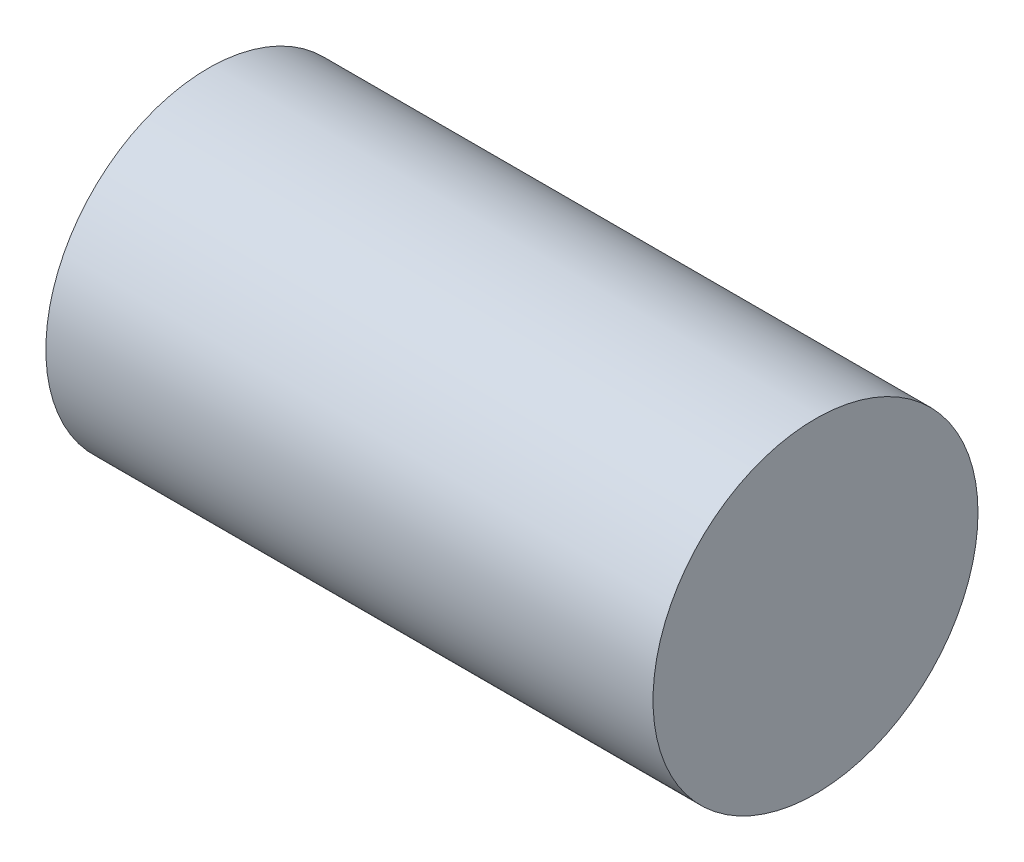
ISO-10303-21;
HEADER;
FILE_DESCRIPTION(('STEP AP214'),'2;1');
FILE_NAME('part.step','',(''),(''),'','','');
FILE_SCHEMA(('AUTOMOTIVE_DESIGN { 1 0 10303 214 1 1 1 1 }'));
ENDSEC;
DATA;
#1=APPLICATION_CONTEXT('core data for automotive mechanical design processes');
#2=APPLICATION_PROTOCOL_DEFINITION('international standard','automotive_design',2000,#1);
#3=PRODUCT_CONTEXT('',#1,'mechanical');
#4=PRODUCT('Part','Part','',(#3));
#5=PRODUCT_RELATED_PRODUCT_CATEGORY('part','',(#4));
#6=PRODUCT_DEFINITION_FORMATION('','',#4);
#7=PRODUCT_DEFINITION_CONTEXT('part definition',#1,'design');
#8=PRODUCT_DEFINITION('design','',#6,#7);
#9=PRODUCT_DEFINITION_SHAPE('','',#8);
#10=(LENGTH_UNIT() NAMED_UNIT(*) SI_UNIT(.MILLI.,.METRE.));
#11=(NAMED_UNIT(*) PLANE_ANGLE_UNIT() SI_UNIT($,.RADIAN.));
#12=(NAMED_UNIT(*) SI_UNIT($,.STERADIAN.) SOLID_ANGLE_UNIT());
#13=UNCERTAINTY_MEASURE_WITH_UNIT(LENGTH_MEASURE(1.E-05),#10,'distance_accuracy_value','');
#14=(GEOMETRIC_REPRESENTATION_CONTEXT(3) GLOBAL_UNCERTAINTY_ASSIGNED_CONTEXT((#13)) GLOBAL_UNIT_ASSIGNED_CONTEXT((#10,
#11,#12)) REPRESENTATION_CONTEXT('',''));
#15=CARTESIAN_POINT('',(0.,0.,0.));
#16=DIRECTION('',(0.,0.,1.));
#17=DIRECTION('',(1.,0.,0.));
#18=AXIS2_PLACEMENT_3D('',#15,#16,#17);
#19=CARTESIAN_POINT('',(5.7658,0.,0.));
#20=DIRECTION('',(-1.,0.,0.));
#21=DIRECTION('',(0.,0.,1.));
#22=AXIS2_PLACEMENT_3D('',#19,#20,#21);
#23=CYLINDRICAL_SURFACE('',#22,3.0861);
#24=CARTESIAN_POINT('',(5.7658,0.,0.));
#25=DIRECTION('',(1.,0.,0.));
#26=DIRECTION('',(0.,0.,-1.));
#27=AXIS2_PLACEMENT_3D('',#24,#25,#26);
#28=CIRCLE('',#27,3.0861);
#29=CARTESIAN_POINT('',(5.7658,0.,-3.0861));
#30=VERTEX_POINT('',#29);
#31=EDGE_CURVE('E10',#30,#30,#28,.T.);
#32=ORIENTED_EDGE('',*,*,#31,.F.);
#33=EDGE_LOOP('',(#32));
#34=FACE_BOUND('',#33,.T.);
#35=CARTESIAN_POINT('',(-5.7658,0.,0.));
#36=DIRECTION('',(1.,0.,0.));
#37=DIRECTION('',(0.,0.,-1.));
#38=AXIS2_PLACEMENT_3D('',#35,#36,#37);
#39=CIRCLE('',#38,3.0861);
#40=CARTESIAN_POINT('',(-5.7658,0.,-3.0861));
#41=VERTEX_POINT('',#40);
#42=EDGE_CURVE('E34',#41,#41,#39,.T.);
#43=ORIENTED_EDGE('',*,*,#42,.T.);
#44=EDGE_LOOP('',(#43));
#45=FACE_BOUND('',#44,.T.);
#46=ADVANCED_FACE('F31',(#34,#45),#23,.T.);
#47=CARTESIAN_POINT('',(5.7658,0.,0.));
#48=DIRECTION('',(1.,0.,0.));
#49=DIRECTION('',(0.,0.,-1.));
#50=AXIS2_PLACEMENT_3D('',#47,#48,#49);
#51=PLANE('',#50);
#52=ORIENTED_EDGE('',*,*,#31,.T.);
#53=EDGE_LOOP('',(#52));
#54=FACE_BOUND('',#53,.T.);
#55=ADVANCED_FACE('F46',(#54),#51,.T.);
#56=CARTESIAN_POINT('',(-5.7658,0.,0.));
#57=DIRECTION('',(1.,0.,0.));
#58=DIRECTION('',(0.,0.,-1.));
#59=AXIS2_PLACEMENT_3D('',#56,#57,#58);
#60=PLANE('',#59);
#61=ORIENTED_EDGE('',*,*,#42,.F.);
#62=EDGE_LOOP('',(#61));
#63=FACE_BOUND('',#62,.T.);
#64=ADVANCED_FACE('F44',(#63),#60,.F.);
#65=CLOSED_SHELL('',(#46,#55,#64));
#66=MANIFOLD_SOLID_BREP('B2',#65);
#67=ADVANCED_BREP_SHAPE_REPRESENTATION('',(#18,#66),#14);
#68=SHAPE_DEFINITION_REPRESENTATION(#9,#67);
ENDSEC;
END-ISO-10303-21;
